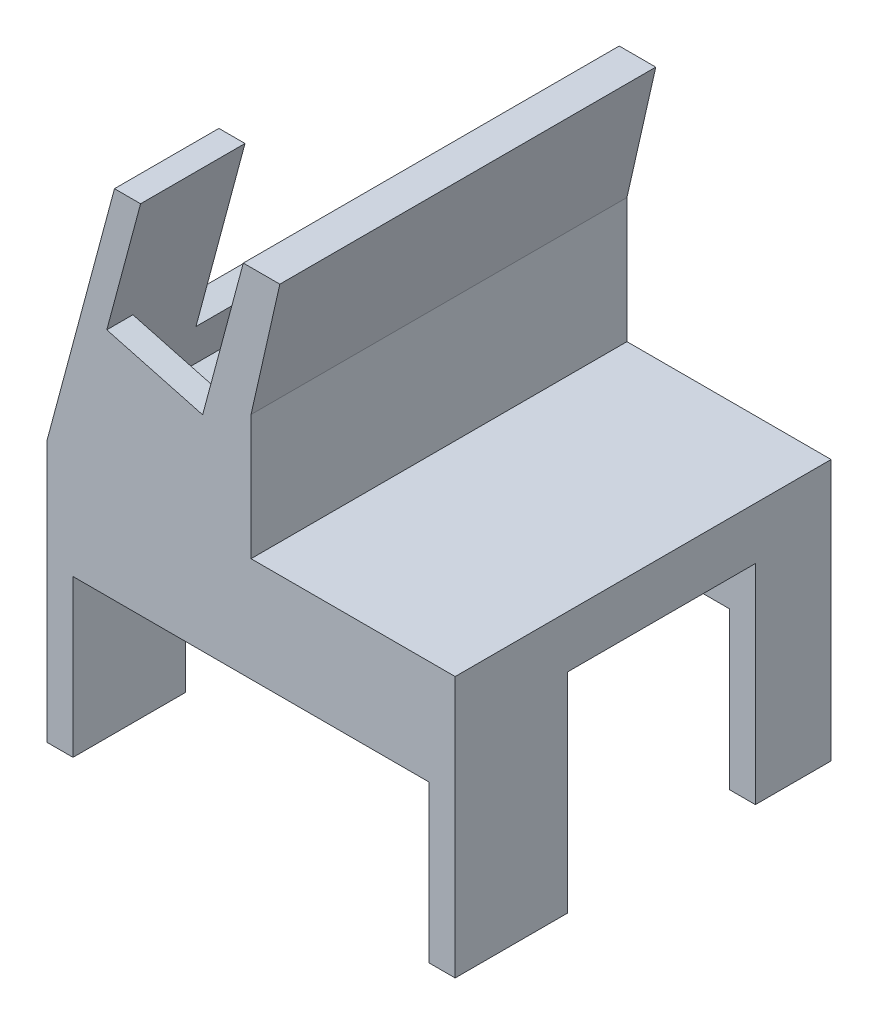
ISO-10303-21;
HEADER;
FILE_DESCRIPTION(('STEP AP214'),'2;1');
FILE_NAME('part.step','',(''),(''),'','','');
FILE_SCHEMA(('AUTOMOTIVE_DESIGN { 1 0 10303 214 1 1 1 1 }'));
ENDSEC;
DATA;
#1=APPLICATION_CONTEXT('core data for automotive mechanical design processes');
#2=APPLICATION_PROTOCOL_DEFINITION('international standard','automotive_design',2000,#1);
#3=PRODUCT_CONTEXT('',#1,'mechanical');
#4=PRODUCT('Part','Part','',(#3));
#5=PRODUCT_RELATED_PRODUCT_CATEGORY('part','',(#4));
#6=PRODUCT_DEFINITION_FORMATION('','',#4);
#7=PRODUCT_DEFINITION_CONTEXT('part definition',#1,'design');
#8=PRODUCT_DEFINITION('design','',#6,#7);
#9=PRODUCT_DEFINITION_SHAPE('','',#8);
#10=(LENGTH_UNIT() NAMED_UNIT(*) SI_UNIT(.MILLI.,.METRE.));
#11=(NAMED_UNIT(*) PLANE_ANGLE_UNIT() SI_UNIT($,.RADIAN.));
#12=(NAMED_UNIT(*) SI_UNIT($,.STERADIAN.) SOLID_ANGLE_UNIT());
#13=UNCERTAINTY_MEASURE_WITH_UNIT(LENGTH_MEASURE(1.E-05),#10,'distance_accuracy_value','');
#14=(GEOMETRIC_REPRESENTATION_CONTEXT(3) GLOBAL_UNCERTAINTY_ASSIGNED_CONTEXT((#13)) GLOBAL_UNIT_ASSIGNED_CONTEXT((#10,
#11,#12)) REPRESENTATION_CONTEXT('',''));
#15=CARTESIAN_POINT('',(0.,0.,0.));
#16=DIRECTION('',(0.,0.,1.));
#17=DIRECTION('',(1.,0.,0.));
#18=AXIS2_PLACEMENT_3D('',#15,#16,#17);
#19=CARTESIAN_POINT('',(-56.4103801603801,13.5714285714286,67.));
#20=DIRECTION('',(-0.965925826289069,0.258819045102518,0.));
#21=DIRECTION('',(-0.258819045102518,-0.965925826289069,0.));
#22=AXIS2_PLACEMENT_3D('',#19,#20,#21);
#23=PLANE('',#22);
#24=DIRECTION('',(0.,0.,1.));
#25=VECTOR('',#24,1.);
#26=CARTESIAN_POINT('',(-43.4694279052542,61.867719885882,67.));
#27=LINE('',#26,#25);
#28=CARTESIAN_POINT('',(-43.4694279052542,61.867719885882,52.));
#29=VERTEX_POINT('',#28);
#30=CARTESIAN_POINT('',(-43.4694279052542,61.867719885882,72.));
#31=VERTEX_POINT('',#30);
#32=EDGE_CURVE('E376',#29,#31,#27,.T.);
#33=ORIENTED_EDGE('',*,*,#32,.F.);
#34=DIRECTION('',(-0.258819045102518,-0.965925826289069,0.));
#35=VECTOR('',#34,1.);
#36=CARTESIAN_POINT('',(-42.6738092932145,64.8370089694618,52.));
#37=LINE('',#36,#35);
#38=CARTESIAN_POINT('',(-52.5280944838424,28.0603159657646,52.));
#39=VERTEX_POINT('',#38);
#40=EDGE_CURVE('E295',#29,#39,#37,.T.);
#41=ORIENTED_EDGE('',*,*,#40,.T.);
#42=DIRECTION('',(0.,0.,1.));
#43=VECTOR('',#42,1.);
#44=CARTESIAN_POINT('',(-52.5280944838424,28.0603159657646,0.));
#45=LINE('',#44,#43);
#46=CARTESIAN_POINT('',(-52.5280944838424,28.0603159657646,0.));
#47=VERTEX_POINT('',#46);
#48=EDGE_CURVE('E288',#47,#39,#45,.T.);
#49=ORIENTED_EDGE('',*,*,#48,.F.);
#50=DIRECTION('',(0.258819045102518,0.965925826289069,0.));
#51=VECTOR('',#50,1.);
#52=CARTESIAN_POINT('',(-56.0244583510607,15.0117083715576,0.));
#53=LINE('',#52,#51);
#54=CARTESIAN_POINT('',(-56.4103801603801,13.5714285714286,0.));
#55=VERTEX_POINT('',#54);
#56=EDGE_CURVE('E300',#55,#47,#53,.T.);
#57=ORIENTED_EDGE('',*,*,#56,.F.);
#58=DIRECTION('',(0.,0.,-1.));
#59=VECTOR('',#58,1.);
#60=CARTESIAN_POINT('',(-56.4103801603801,13.5714285714286,72.));
#61=LINE('',#60,#59);
#62=CARTESIAN_POINT('',(-56.4103801603801,13.5714285714286,72.));
#63=VERTEX_POINT('',#62);
#64=EDGE_CURVE('E483',#63,#55,#61,.T.);
#65=ORIENTED_EDGE('',*,*,#64,.F.);
#66=DIRECTION('',(-0.258819045102518,-0.965925826289069,0.));
#67=VECTOR('',#66,1.);
#68=CARTESIAN_POINT('',(-56.4103801603801,13.5714285714286,72.));
#69=LINE('',#68,#67);
#70=EDGE_CURVE('E346',#31,#63,#69,.T.);
#71=ORIENTED_EDGE('',*,*,#70,.F.);
#72=EDGE_LOOP('',(#33,#41,#49,#57,#65,#71));
#73=FACE_BOUND('',#72,.T.);
#74=ADVANCED_FACE('F101',(#73),#23,.T.);
#75=CARTESIAN_POINT('',(-43.4694279052542,61.867719885882,67.));
#76=DIRECTION('',(0.,1.,0.));
#77=DIRECTION('',(0.,0.,1.));
#78=AXIS2_PLACEMENT_3D('',#75,#76,#77);
#79=PLANE('',#78);
#80=DIRECTION('',(0.,0.,1.));
#81=VECTOR('',#80,1.);
#82=CARTESIAN_POINT('',(-38.4694279052542,61.867719885882,67.));
#83=LINE('',#82,#81);
#84=CARTESIAN_POINT('',(-38.4694279052542,61.867719885882,52.));
#85=VERTEX_POINT('',#84);
#86=CARTESIAN_POINT('',(-38.4694279052542,61.867719885882,72.));
#87=VERTEX_POINT('',#86);
#88=EDGE_CURVE('E380',#85,#87,#83,.T.);
#89=ORIENTED_EDGE('',*,*,#88,.F.);
#90=DIRECTION('',(-1.,0.,0.));
#91=VECTOR('',#90,1.);
#92=CARTESIAN_POINT('',(-43.4694279052542,61.867719885882,52.));
#93=LINE('',#92,#91);
#94=EDGE_CURVE('E599',#85,#29,#93,.T.);
#95=ORIENTED_EDGE('',*,*,#94,.T.);
#96=ORIENTED_EDGE('',*,*,#32,.T.);
#97=DIRECTION('',(-1.,0.,0.));
#98=VECTOR('',#97,1.);
#99=CARTESIAN_POINT('',(-43.4694279052542,61.867719885882,72.));
#100=LINE('',#99,#98);
#101=EDGE_CURVE('E369',#87,#31,#100,.T.);
#102=ORIENTED_EDGE('',*,*,#101,.F.);
#103=EDGE_LOOP('',(#89,#95,#96,#102));
#104=FACE_BOUND('',#103,.T.);
#105=ADVANCED_FACE('F597',(#104),#79,.T.);
#106=CARTESIAN_POINT('',(-38.4694279052542,61.867719885882,67.));
#107=DIRECTION('',(0.965925826289069,-0.258819045102518,0.));
#108=DIRECTION('',(0.258819045102518,0.965925826289069,0.));
#109=AXIS2_PLACEMENT_3D('',#106,#107,#108);
#110=PLANE('',#109);
#111=DIRECTION('',(0.,0.,-1.));
#112=VECTOR('',#111,1.);
#113=CARTESIAN_POINT('',(-47.8630309743813,26.8103159657646,67.));
#114=LINE('',#113,#112);
#115=CARTESIAN_POINT('',(-47.8630309743813,26.8103159657646,52.));
#116=VERTEX_POINT('',#115);
#117=CARTESIAN_POINT('',(-47.8630309743813,26.8103159657646,0.));
#118=VERTEX_POINT('',#117);
#119=EDGE_CURVE('E110',#116,#118,#114,.T.);
#120=ORIENTED_EDGE('',*,*,#119,.F.);
#121=DIRECTION('',(0.258819045102518,0.965925826289069,0.));
#122=VECTOR('',#121,1.);
#123=CARTESIAN_POINT('',(-38.4694279052542,61.867719885882,52.));
#124=LINE('',#123,#122);
#125=EDGE_CURVE('E12',#116,#85,#124,.T.);
#126=ORIENTED_EDGE('',*,*,#125,.T.);
#127=ORIENTED_EDGE('',*,*,#88,.T.);
#128=DIRECTION('',(0.258819045102518,0.965925826289069,0.));
#129=VECTOR('',#128,1.);
#130=CARTESIAN_POINT('',(-38.4694279052542,61.867719885882,72.));
#131=LINE('',#130,#129);
#132=CARTESIAN_POINT('',(-44.9399040328172,37.7195742286553,72.));
#133=VERTEX_POINT('',#132);
#134=EDGE_CURVE('E365',#133,#87,#131,.T.);
#135=ORIENTED_EDGE('',*,*,#134,.F.);
#136=DIRECTION('',(0.,0.,1.));
#137=VECTOR('',#136,1.);
#138=CARTESIAN_POINT('',(-44.9399040328172,37.7195742286553,67.));
#139=LINE('',#138,#137);
#140=CARTESIAN_POINT('',(-44.9399040328172,37.7195742286553,67.));
#141=VERTEX_POINT('',#140);
#142=EDGE_CURVE('E383',#141,#133,#139,.T.);
#143=ORIENTED_EDGE('',*,*,#142,.F.);
#144=DIRECTION('',(0.258819045102518,0.965925826289069,0.));
#145=VECTOR('',#144,1.);
#146=CARTESIAN_POINT('',(-51.3593948415996,13.7617083715576,67.));
#147=LINE('',#146,#145);
#148=CARTESIAN_POINT('',(-50.0927234320809,18.4889904283764,67.));
#149=VERTEX_POINT('',#148);
#150=EDGE_CURVE('E558',#149,#141,#147,.T.);
#151=ORIENTED_EDGE('',*,*,#150,.F.);
#152=DIRECTION('',(0.,0.,1.));
#153=VECTOR('',#152,1.);
#154=CARTESIAN_POINT('',(-50.0927234320809,18.4889904283764,0.));
#155=LINE('',#154,#153);
#156=CARTESIAN_POINT('',(-50.0927234320809,18.4889904283764,0.));
#157=VERTEX_POINT('',#156);
#158=EDGE_CURVE('E324',#157,#149,#155,.T.);
#159=ORIENTED_EDGE('',*,*,#158,.F.);
#160=DIRECTION('',(-0.258819045102518,-0.965925826289069,0.));
#161=VECTOR('',#160,1.);
#162=CARTESIAN_POINT('',(-51.3593948415996,13.7617083715576,0.));
#163=LINE('',#162,#161);
#164=EDGE_CURVE('E317',#118,#157,#163,.T.);
#165=ORIENTED_EDGE('',*,*,#164,.F.);
#166=EDGE_LOOP('',(#120,#126,#127,#135,#143,#151,#159,#165));
#167=FACE_BOUND('',#166,.T.);
#168=ADVANCED_FACE('F633',(#167),#110,.T.);
#169=CARTESIAN_POINT('',(0.,0.,67.));
#170=DIRECTION('',(0.,0.,-1.));
#171=DIRECTION('',(-1.,0.,0.));
#172=AXIS2_PLACEMENT_3D('',#169,#170,#171);
#173=PLANE('',#172);
#174=DIRECTION('',(0.965925826289069,-0.258819045102518,0.));
#175=VECTOR('',#174,1.);
#176=CARTESIAN_POINT('',(1.26667140951872,4.72728205681879,67.));
#177=LINE('',#176,#175);
#178=CARTESIAN_POINT('',(-31.7401327325886,13.5714285714286,67.));
#179=VERTEX_POINT('',#178);
#180=EDGE_CURVE('E320',#149,#179,#177,.T.);
#181=ORIENTED_EDGE('',*,*,#180,.F.);
#182=ORIENTED_EDGE('',*,*,#150,.T.);
#183=DIRECTION('',(-0.965925826289069,0.258819045102518,0.));
#184=VECTOR('',#183,1.);
#185=CARTESIAN_POINT('',(-44.9399040328172,37.7195742286553,67.));
#186=LINE('',#185,#184);
#187=CARTESIAN_POINT('',(-26.5873133333249,32.8020123717075,67.));
#188=VERTEX_POINT('',#187);
#189=EDGE_CURVE('E341',#188,#141,#186,.T.);
#190=ORIENTED_EDGE('',*,*,#189,.F.);
#191=DIRECTION('',(0.258819045102517,0.965925826289069,0.));
#192=VECTOR('',#191,1.);
#193=CARTESIAN_POINT('',(-33.0068041421073,8.84414651460977,67.));
#194=LINE('',#193,#192);
#195=EDGE_CURVE('E532',#179,#188,#194,.T.);
#196=ORIENTED_EDGE('',*,*,#195,.F.);
#197=EDGE_LOOP('',(#181,#182,#190,#196));
#198=FACE_BOUND('',#197,.T.);
#199=ADVANCED_FACE('F617',(#198),#173,.T.);
#200=CARTESIAN_POINT('',(0.,13.5714285714286,72.));
#201=DIRECTION('',(0.,1.,0.));
#202=DIRECTION('',(0.,0.,1.));
#203=AXIS2_PLACEMENT_3D('',#200,#201,#202);
#204=PLANE('',#203);
#205=DIRECTION('',(1.,0.,0.));
#206=VECTOR('',#205,1.);
#207=CARTESIAN_POINT('',(0.,13.5714285714286,0.));
#208=LINE('',#207,#206);
#209=CARTESIAN_POINT('',(-17.3169735669735,13.5714285714286,0.));
#210=VERTEX_POINT('',#209);
#211=CARTESIAN_POINT('',(21.7764330264331,13.5714285714286,0.));
#212=VERTEX_POINT('',#211);
#213=EDGE_CURVE('E501',#210,#212,#208,.T.);
#214=ORIENTED_EDGE('',*,*,#213,.F.);
#215=DIRECTION('',(0.,0.,1.));
#216=VECTOR('',#215,1.);
#217=CARTESIAN_POINT('',(-17.3169735669735,13.5714285714286,67.));
#218=LINE('',#217,#216);
#219=CARTESIAN_POINT('',(-17.3169735669735,13.5714285714286,72.));
#220=VERTEX_POINT('',#219);
#221=EDGE_CURVE('E345',#210,#220,#218,.T.);
#222=ORIENTED_EDGE('',*,*,#221,.T.);
#223=DIRECTION('',(1.,0.,0.));
#224=VECTOR('',#223,1.);
#225=CARTESIAN_POINT('',(0.,13.5714285714286,72.));
#226=LINE('',#225,#224);
#227=CARTESIAN_POINT('',(21.7764330264331,13.5714285714286,72.));
#228=VERTEX_POINT('',#227);
#229=EDGE_CURVE('E476',#220,#228,#226,.T.);
#230=ORIENTED_EDGE('',*,*,#229,.T.);
#231=DIRECTION('',(0.,0.,-1.));
#232=VECTOR('',#231,1.);
#233=CARTESIAN_POINT('',(21.7764330264331,13.5714285714286,72.));
#234=LINE('',#233,#232);
#235=EDGE_CURVE('E508',#228,#212,#234,.T.);
#236=ORIENTED_EDGE('',*,*,#235,.T.);
#237=EDGE_LOOP('',(#214,#222,#230,#236));
#238=FACE_BOUND('',#237,.T.);
#239=ADVANCED_FACE('F686',(#238),#204,.T.);
#240=CARTESIAN_POINT('',(16.7764330264331,0.,72.));
#241=DIRECTION('',(1.,0.,0.));
#242=DIRECTION('',(0.,0.,-1.));
#243=AXIS2_PLACEMENT_3D('',#240,#241,#242);
#244=PLANE('',#243);
#245=DIRECTION('',(0.,0.,-1.));
#246=VECTOR('',#245,1.);
#247=CARTESIAN_POINT('',(16.7764330264331,-6.42857142857144,72.));
#248=LINE('',#247,#246);
#249=CARTESIAN_POINT('',(16.7764330264331,-6.42857142857144,72.));
#250=VERTEX_POINT('',#249);
#251=CARTESIAN_POINT('',(16.7764330264331,-6.42857142857144,50.5));
#252=VERTEX_POINT('',#251);
#253=EDGE_CURVE('E523',#250,#252,#248,.T.);
#254=ORIENTED_EDGE('',*,*,#253,.T.);
#255=DIRECTION('',(0.,-1.,0.));
#256=VECTOR('',#255,1.);
#257=CARTESIAN_POINT('',(16.7764330264331,3.57142857142857,50.5));
#258=LINE('',#257,#256);
#259=CARTESIAN_POINT('',(16.7764330264331,-36.4285714285714,50.5));
#260=VERTEX_POINT('',#259);
#261=EDGE_CURVE('E410',#252,#260,#258,.T.);
#262=ORIENTED_EDGE('',*,*,#261,.T.);
#263=DIRECTION('',(0.,0.,-1.));
#264=VECTOR('',#263,1.);
#265=CARTESIAN_POINT('',(16.7764330264331,-36.4285714285714,72.));
#266=LINE('',#265,#264);
#267=CARTESIAN_POINT('',(16.7764330264331,-36.4285714285714,72.));
#268=VERTEX_POINT('',#267);
#269=EDGE_CURVE('E518',#268,#260,#266,.T.);
#270=ORIENTED_EDGE('',*,*,#269,.F.);
#271=DIRECTION('',(0.,-1.,0.));
#272=VECTOR('',#271,1.);
#273=CARTESIAN_POINT('',(16.7764330264331,0.,72.));
#274=LINE('',#273,#272);
#275=EDGE_CURVE('E465',#250,#268,#274,.T.);
#276=ORIENTED_EDGE('',*,*,#275,.F.);
#277=EDGE_LOOP('',(#254,#262,#270,#276));
#278=FACE_BOUND('',#277,.T.);
#279=ADVANCED_FACE('F689',(#278),#244,.F.);
#280=CARTESIAN_POINT('',(0.,-36.4285714285714,72.));
#281=DIRECTION('',(0.,-1.,0.));
#282=DIRECTION('',(0.,0.,-1.));
#283=AXIS2_PLACEMENT_3D('',#280,#281,#282);
#284=PLANE('',#283);
#285=DIRECTION('',(-1.,0.,0.));
#286=VECTOR('',#285,1.);
#287=CARTESIAN_POINT('',(16.7764330264331,-36.4285714285714,50.5));
#288=LINE('',#287,#286);
#289=CARTESIAN_POINT('',(21.7764330264331,-36.4285714285714,50.5));
#290=VERTEX_POINT('',#289);
#291=EDGE_CURVE('E405',#290,#260,#288,.T.);
#292=ORIENTED_EDGE('',*,*,#291,.F.);
#293=DIRECTION('',(0.,0.,-1.));
#294=VECTOR('',#293,1.);
#295=CARTESIAN_POINT('',(21.7764330264331,-36.4285714285714,72.));
#296=LINE('',#295,#294);
#297=CARTESIAN_POINT('',(21.7764330264331,-36.4285714285714,72.));
#298=VERTEX_POINT('',#297);
#299=EDGE_CURVE('E513',#298,#290,#296,.T.);
#300=ORIENTED_EDGE('',*,*,#299,.F.);
#301=DIRECTION('',(-1.,0.,0.));
#302=VECTOR('',#301,1.);
#303=CARTESIAN_POINT('',(0.,-36.4285714285714,72.));
#304=LINE('',#303,#302);
#305=EDGE_CURVE('E468',#298,#268,#304,.T.);
#306=ORIENTED_EDGE('',*,*,#305,.T.);
#307=ORIENTED_EDGE('',*,*,#269,.T.);
#308=EDGE_LOOP('',(#292,#300,#306,#307));
#309=FACE_BOUND('',#308,.T.);
#310=ADVANCED_FACE('F699',(#309),#284,.T.);
#311=CARTESIAN_POINT('',(-56.4103801603801,-36.4285714285714,72.));
#312=DIRECTION('',(0.,1.,0.));
#313=DIRECTION('',(0.,0.,1.));
#314=AXIS2_PLACEMENT_3D('',#311,#312,#313);
#315=PLANE('',#314);
#316=DIRECTION('',(0.,0.,-1.));
#317=VECTOR('',#316,1.);
#318=CARTESIAN_POINT('',(-51.4103801603801,-36.4285714285714,72.));
#319=LINE('',#318,#317);
#320=CARTESIAN_POINT('',(-51.4103801603801,-36.4285714285714,14.5));
#321=VERTEX_POINT('',#320);
#322=CARTESIAN_POINT('',(-51.4103801603801,-36.4285714285714,0.));
#323=VERTEX_POINT('',#322);
#324=EDGE_CURVE('E541',#321,#323,#319,.T.);
#325=ORIENTED_EDGE('',*,*,#324,.F.);
#326=DIRECTION('',(1.,0.,0.));
#327=VECTOR('',#326,1.);
#328=CARTESIAN_POINT('',(-51.4103801603801,-36.4285714285714,14.5));
#329=LINE('',#328,#327);
#330=CARTESIAN_POINT('',(-56.4103801603801,-36.4285714285714,14.5));
#331=VERTEX_POINT('',#330);
#332=EDGE_CURVE('E429',#331,#321,#329,.T.);
#333=ORIENTED_EDGE('',*,*,#332,.F.);
#334=DIRECTION('',(0.,0.,-1.));
#335=VECTOR('',#334,1.);
#336=CARTESIAN_POINT('',(-56.4103801603801,-36.4285714285714,72.));
#337=LINE('',#336,#335);
#338=CARTESIAN_POINT('',(-56.4103801603801,-36.4285714285714,0.));
#339=VERTEX_POINT('',#338);
#340=EDGE_CURVE('E551',#331,#339,#337,.T.);
#341=ORIENTED_EDGE('',*,*,#340,.T.);
#342=DIRECTION('',(1.,0.,0.));
#343=VECTOR('',#342,1.);
#344=CARTESIAN_POINT('',(-56.4103801603801,-36.4285714285714,0.));
#345=LINE('',#344,#343);
#346=EDGE_CURVE('E538',#339,#323,#345,.T.);
#347=ORIENTED_EDGE('',*,*,#346,.T.);
#348=EDGE_LOOP('',(#325,#333,#341,#347));
#349=FACE_BOUND('',#348,.T.);
#350=ADVANCED_FACE('F575',(#349),#315,.F.);
#351=CARTESIAN_POINT('',(-51.4103801603801,-6.42857142857144,72.));
#352=DIRECTION('',(1.,0.,0.));
#353=DIRECTION('',(0.,1.,0.));
#354=AXIS2_PLACEMENT_3D('',#351,#352,#353);
#355=PLANE('',#354);
#356=DIRECTION('',(0.,-1.,0.));
#357=VECTOR('',#356,1.);
#358=CARTESIAN_POINT('',(-51.4103801603801,3.57142857142857,14.5));
#359=LINE('',#358,#357);
#360=CARTESIAN_POINT('',(-51.4103801603801,-6.42857142857144,14.5));
#361=VERTEX_POINT('',#360);
#362=EDGE_CURVE('E434',#361,#321,#359,.T.);
#363=ORIENTED_EDGE('',*,*,#362,.T.);
#364=ORIENTED_EDGE('',*,*,#324,.T.);
#365=DIRECTION('',(0.,-1.,0.));
#366=VECTOR('',#365,1.);
#367=CARTESIAN_POINT('',(-51.4103801603801,-6.42857142857144,0.));
#368=LINE('',#367,#366);
#369=CARTESIAN_POINT('',(-51.4103801603801,-6.42857142857144,0.));
#370=VERTEX_POINT('',#369);
#371=EDGE_CURVE('E455',#370,#323,#368,.T.);
#372=ORIENTED_EDGE('',*,*,#371,.F.);
#373=DIRECTION('',(0.,0.,-1.));
#374=VECTOR('',#373,1.);
#375=CARTESIAN_POINT('',(-51.4103801603801,-6.42857142857144,72.));
#376=LINE('',#375,#374);
#377=EDGE_CURVE('E527',#361,#370,#376,.T.);
#378=ORIENTED_EDGE('',*,*,#377,.F.);
#379=EDGE_LOOP('',(#363,#364,#372,#378));
#380=FACE_BOUND('',#379,.T.);
#381=ADVANCED_FACE('F570',(#380),#355,.T.);
#382=CARTESIAN_POINT('',(0.,-6.42857142857144,72.));
#383=DIRECTION('',(0.,1.,0.));
#384=DIRECTION('',(-1.,0.,0.));
#385=AXIS2_PLACEMENT_3D('',#382,#383,#384);
#386=PLANE('',#385);
#387=CARTESIAN_POINT('',(-51.4103801603801,-6.42857142857144,72.));
#388=VERTEX_POINT('',#387);
#389=CARTESIAN_POINT('',(-51.4103801603801,-6.42857142857144,50.5));
#390=VERTEX_POINT('',#389);
#391=EDGE_CURVE('E528',#388,#390,#376,.T.);
#392=ORIENTED_EDGE('',*,*,#391,.T.);
#393=DIRECTION('',(-1.,0.,0.));
#394=VECTOR('',#393,1.);
#395=CARTESIAN_POINT('',(-51.4103801603801,-6.42857142857144,50.5));
#396=LINE('',#395,#394);
#397=EDGE_CURVE('E452',#252,#390,#396,.T.);
#398=ORIENTED_EDGE('',*,*,#397,.F.);
#399=ORIENTED_EDGE('',*,*,#253,.F.);
#400=DIRECTION('',(1.,0.,0.));
#401=VECTOR('',#400,1.);
#402=CARTESIAN_POINT('',(0.,-6.42857142857144,72.));
#403=LINE('',#402,#401);
#404=EDGE_CURVE('E462',#388,#250,#403,.T.);
#405=ORIENTED_EDGE('',*,*,#404,.F.);
#406=EDGE_LOOP('',(#392,#398,#399,#405));
#407=FACE_BOUND('',#406,.T.);
#408=ADVANCED_FACE('F704',(#407),#386,.F.);
#409=CARTESIAN_POINT('',(16.7764330264331,-6.42857142857144,14.5));
#410=VERTEX_POINT('',#409);
#411=CARTESIAN_POINT('',(16.7764330264331,-6.42857142857144,0.));
#412=VERTEX_POINT('',#411);
#413=EDGE_CURVE('E522',#410,#412,#248,.T.);
#414=ORIENTED_EDGE('',*,*,#413,.F.);
#415=DIRECTION('',(1.,0.,0.));
#416=VECTOR('',#415,1.);
#417=CARTESIAN_POINT('',(-51.4103801603801,-6.42857142857144,14.5));
#418=LINE('',#417,#416);
#419=EDGE_CURVE('E438',#361,#410,#418,.T.);
#420=ORIENTED_EDGE('',*,*,#419,.F.);
#421=ORIENTED_EDGE('',*,*,#377,.T.);
#422=DIRECTION('',(1.,0.,0.));
#423=VECTOR('',#422,1.);
#424=CARTESIAN_POINT('',(0.,-6.42857142857144,0.));
#425=LINE('',#424,#423);
#426=EDGE_CURVE('E484',#370,#412,#425,.T.);
#427=ORIENTED_EDGE('',*,*,#426,.T.);
#428=EDGE_LOOP('',(#414,#420,#421,#427));
#429=FACE_BOUND('',#428,.T.);
#430=ADVANCED_FACE('F580',(#429),#386,.F.);
#431=CARTESIAN_POINT('',(16.7764330264331,-36.4285714285714,14.5));
#432=VERTEX_POINT('',#431);
#433=CARTESIAN_POINT('',(16.7764330264331,-36.4285714285714,0.));
#434=VERTEX_POINT('',#433);
#435=EDGE_CURVE('E517',#432,#434,#266,.T.);
#436=ORIENTED_EDGE('',*,*,#435,.F.);
#437=DIRECTION('',(0.,-1.,0.));
#438=VECTOR('',#437,1.);
#439=CARTESIAN_POINT('',(16.7764330264331,3.57142857142857,14.5));
#440=LINE('',#439,#438);
#441=EDGE_CURVE('E404',#410,#432,#440,.T.);
#442=ORIENTED_EDGE('',*,*,#441,.F.);
#443=ORIENTED_EDGE('',*,*,#413,.T.);
#444=DIRECTION('',(0.,-1.,0.));
#445=VECTOR('',#444,1.);
#446=CARTESIAN_POINT('',(16.7764330264331,0.,0.));
#447=LINE('',#446,#445);
#448=EDGE_CURVE('E488',#412,#434,#447,.T.);
#449=ORIENTED_EDGE('',*,*,#448,.T.);
#450=EDGE_LOOP('',(#436,#442,#443,#449));
#451=FACE_BOUND('',#450,.T.);
#452=ADVANCED_FACE('F697',(#451),#244,.F.);
#453=DIRECTION('',(1.,0.,0.));
#454=VECTOR('',#453,1.);
#455=CARTESIAN_POINT('',(16.7764330264331,-36.4285714285714,14.5));
#456=LINE('',#455,#454);
#457=CARTESIAN_POINT('',(21.7764330264331,-36.4285714285714,14.5));
#458=VERTEX_POINT('',#457);
#459=EDGE_CURVE('E379',#432,#458,#456,.T.);
#460=ORIENTED_EDGE('',*,*,#459,.F.);
#461=ORIENTED_EDGE('',*,*,#435,.T.);
#462=DIRECTION('',(-1.,0.,0.));
#463=VECTOR('',#462,1.);
#464=CARTESIAN_POINT('',(0.,-36.4285714285714,0.));
#465=LINE('',#464,#463);
#466=CARTESIAN_POINT('',(21.7764330264331,-36.4285714285714,0.));
#467=VERTEX_POINT('',#466);
#468=EDGE_CURVE('E493',#467,#434,#465,.T.);
#469=ORIENTED_EDGE('',*,*,#468,.F.);
#470=EDGE_CURVE('E512',#458,#467,#296,.T.);
#471=ORIENTED_EDGE('',*,*,#470,.F.);
#472=EDGE_LOOP('',(#460,#461,#469,#471));
#473=FACE_BOUND('',#472,.T.);
#474=ADVANCED_FACE('F693',(#473),#284,.T.);
#475=CARTESIAN_POINT('',(21.7764330264331,0.,72.));
#476=DIRECTION('',(-1.,0.,0.));
#477=DIRECTION('',(0.,-1.,0.));
#478=AXIS2_PLACEMENT_3D('',#475,#476,#477);
#479=PLANE('',#478);
#480=ORIENTED_EDGE('',*,*,#299,.T.);
#481=DIRECTION('',(0.,-1.,0.));
#482=VECTOR('',#481,1.);
#483=CARTESIAN_POINT('',(21.7764330264331,3.57142857142857,50.5));
#484=LINE('',#483,#482);
#485=CARTESIAN_POINT('',(21.7764330264331,3.57142857142857,50.5));
#486=VERTEX_POINT('',#485);
#487=EDGE_CURVE('E415',#486,#290,#484,.T.);
#488=ORIENTED_EDGE('',*,*,#487,.F.);
#489=DIRECTION('',(0.,0.,1.));
#490=VECTOR('',#489,1.);
#491=CARTESIAN_POINT('',(21.7764330264331,3.57142857142857,50.5));
#492=LINE('',#491,#490);
#493=CARTESIAN_POINT('',(21.7764330264331,3.57142857142857,14.5));
#494=VERTEX_POINT('',#493);
#495=EDGE_CURVE('E400',#494,#486,#492,.T.);
#496=ORIENTED_EDGE('',*,*,#495,.F.);
#497=DIRECTION('',(0.,-1.,0.));
#498=VECTOR('',#497,1.);
#499=CARTESIAN_POINT('',(21.7764330264331,3.57142857142857,14.5));
#500=LINE('',#499,#498);
#501=EDGE_CURVE('E418',#494,#458,#500,.T.);
#502=ORIENTED_EDGE('',*,*,#501,.T.);
#503=ORIENTED_EDGE('',*,*,#470,.T.);
#504=DIRECTION('',(0.,1.,0.));
#505=VECTOR('',#504,1.);
#506=CARTESIAN_POINT('',(21.7764330264331,0.,0.));
#507=LINE('',#506,#505);
#508=EDGE_CURVE('E497',#467,#212,#507,.T.);
#509=ORIENTED_EDGE('',*,*,#508,.T.);
#510=ORIENTED_EDGE('',*,*,#235,.F.);
#511=DIRECTION('',(0.,1.,0.));
#512=VECTOR('',#511,1.);
#513=CARTESIAN_POINT('',(21.7764330264331,0.,72.));
#514=LINE('',#513,#512);
#515=EDGE_CURVE('E472',#298,#228,#514,.T.);
#516=ORIENTED_EDGE('',*,*,#515,.F.);
#517=EDGE_LOOP('',(#480,#488,#496,#502,#503,#509,#510,#516));
#518=FACE_BOUND('',#517,.T.);
#519=ADVANCED_FACE('F685',(#518),#479,.F.);
#520=CARTESIAN_POINT('',(-56.4103801603801,0.,72.));
#521=DIRECTION('',(-1.,0.,0.));
#522=DIRECTION('',(0.,0.,1.));
#523=AXIS2_PLACEMENT_3D('',#520,#521,#522);
#524=PLANE('',#523);
#525=DIRECTION('',(0.,-1.,0.));
#526=VECTOR('',#525,1.);
#527=CARTESIAN_POINT('',(-56.4103801603801,3.57142857142857,14.5));
#528=LINE('',#527,#526);
#529=CARTESIAN_POINT('',(-56.4103801603801,3.57142857142857,14.5));
#530=VERTEX_POINT('',#529);
#531=EDGE_CURVE('E439',#530,#331,#528,.T.);
#532=ORIENTED_EDGE('',*,*,#531,.F.);
#533=DIRECTION('',(0.,0.,-1.));
#534=VECTOR('',#533,1.);
#535=CARTESIAN_POINT('',(-56.4103801603801,3.57142857142857,14.5));
#536=LINE('',#535,#534);
#537=CARTESIAN_POINT('',(-56.4103801603801,3.57142857142857,50.5));
#538=VERTEX_POINT('',#537);
#539=EDGE_CURVE('E424',#538,#530,#536,.T.);
#540=ORIENTED_EDGE('',*,*,#539,.F.);
#541=DIRECTION('',(0.,-1.,0.));
#542=VECTOR('',#541,1.);
#543=CARTESIAN_POINT('',(-56.4103801603801,3.57142857142857,50.5));
#544=LINE('',#543,#542);
#545=CARTESIAN_POINT('',(-56.4103801603801,-36.4285714285714,50.5));
#546=VERTEX_POINT('',#545);
#547=EDGE_CURVE('E442',#538,#546,#544,.T.);
#548=ORIENTED_EDGE('',*,*,#547,.T.);
#549=CARTESIAN_POINT('',(-56.4103801603801,-36.4285714285714,72.));
#550=VERTEX_POINT('',#549);
#551=EDGE_CURVE('E489',#550,#546,#337,.T.);
#552=ORIENTED_EDGE('',*,*,#551,.F.);
#553=DIRECTION('',(0.,1.,0.));
#554=VECTOR('',#553,1.);
#555=CARTESIAN_POINT('',(-56.4103801603801,0.,72.));
#556=LINE('',#555,#554);
#557=EDGE_CURVE('E479',#550,#63,#556,.T.);
#558=ORIENTED_EDGE('',*,*,#557,.T.);
#559=ORIENTED_EDGE('',*,*,#64,.T.);
#560=DIRECTION('',(0.,1.,0.));
#561=VECTOR('',#560,1.);
#562=CARTESIAN_POINT('',(-56.4103801603801,0.,0.));
#563=LINE('',#562,#561);
#564=EDGE_CURVE('E307',#339,#55,#563,.T.);
#565=ORIENTED_EDGE('',*,*,#564,.F.);
#566=ORIENTED_EDGE('',*,*,#340,.F.);
#567=EDGE_LOOP('',(#532,#540,#548,#552,#558,#559,#565,#566));
#568=FACE_BOUND('',#567,.T.);
#569=ADVANCED_FACE('F587',(#568),#524,.T.);
#570=CARTESIAN_POINT('',(0.,0.,72.));
#571=DIRECTION('',(0.,0.,1.));
#572=DIRECTION('',(1.,0.,0.));
#573=AXIS2_PLACEMENT_3D('',#570,#571,#572);
#574=PLANE('',#573);
#575=ORIENTED_EDGE('',*,*,#557,.F.);
#576=DIRECTION('',(1.,0.,0.));
#577=VECTOR('',#576,1.);
#578=CARTESIAN_POINT('',(-56.4103801603801,-36.4285714285714,72.));
#579=LINE('',#578,#577);
#580=CARTESIAN_POINT('',(-51.4103801603801,-36.4285714285714,72.));
#581=VERTEX_POINT('',#580);
#582=EDGE_CURVE('E537',#550,#581,#579,.T.);
#583=ORIENTED_EDGE('',*,*,#582,.T.);
#584=DIRECTION('',(0.,-1.,0.));
#585=VECTOR('',#584,1.);
#586=CARTESIAN_POINT('',(-51.4103801603801,-6.42857142857144,72.));
#587=LINE('',#586,#585);
#588=EDGE_CURVE('E533',#388,#581,#587,.T.);
#589=ORIENTED_EDGE('',*,*,#588,.F.);
#590=ORIENTED_EDGE('',*,*,#404,.T.);
#591=ORIENTED_EDGE('',*,*,#275,.T.);
#592=ORIENTED_EDGE('',*,*,#305,.F.);
#593=ORIENTED_EDGE('',*,*,#515,.T.);
#594=ORIENTED_EDGE('',*,*,#229,.F.);
#595=DIRECTION('',(0.,1.,0.));
#596=VECTOR('',#595,1.);
#597=CARTESIAN_POINT('',(-17.3169735669735,13.5714285714286,72.));
#598=LINE('',#597,#596);
#599=CARTESIAN_POINT('',(-17.3169735669735,37.4842427051896,72.));
#600=VERTEX_POINT('',#599);
#601=EDGE_CURVE('E125',#220,#600,#598,.T.);
#602=ORIENTED_EDGE('',*,*,#601,.T.);
#603=DIRECTION('',(0.220711723580433,0.975339087227696,0.));
#604=VECTOR('',#603,1.);
#605=CARTESIAN_POINT('',(-17.3169735669735,37.4842427051896,72.));
#606=LINE('',#605,#604);
#607=CARTESIAN_POINT('',(-11.7991804774627,61.867719885882,72.));
#608=VERTEX_POINT('',#607);
#609=EDGE_CURVE('E349',#600,#608,#606,.T.);
#610=ORIENTED_EDGE('',*,*,#609,.T.);
#611=DIRECTION('',(-1.,0.,0.));
#612=VECTOR('',#611,1.);
#613=CARTESIAN_POINT('',(-18.7991804774627,61.867719885882,72.));
#614=LINE('',#613,#612);
#615=CARTESIAN_POINT('',(-18.7991804774627,61.867719885882,72.));
#616=VERTEX_POINT('',#615);
#617=EDGE_CURVE('E353',#608,#616,#614,.T.);
#618=ORIENTED_EDGE('',*,*,#617,.T.);
#619=DIRECTION('',(-0.258819045102517,-0.965925826289069,0.));
#620=VECTOR('',#619,1.);
#621=CARTESIAN_POINT('',(-26.5873133333249,32.8020123717075,72.));
#622=LINE('',#621,#620);
#623=CARTESIAN_POINT('',(-26.5873133333249,32.8020123717075,72.));
#624=VERTEX_POINT('',#623);
#625=EDGE_CURVE('E357',#616,#624,#622,.T.);
#626=ORIENTED_EDGE('',*,*,#625,.T.);
#627=DIRECTION('',(-0.965925826289069,0.258819045102518,0.));
#628=VECTOR('',#627,1.);
#629=CARTESIAN_POINT('',(-44.9399040328172,37.7195742286553,72.));
#630=LINE('',#629,#628);
#631=EDGE_CURVE('E361',#624,#133,#630,.T.);
#632=ORIENTED_EDGE('',*,*,#631,.T.);
#633=ORIENTED_EDGE('',*,*,#134,.T.);
#634=ORIENTED_EDGE('',*,*,#101,.T.);
#635=ORIENTED_EDGE('',*,*,#70,.T.);
#636=EDGE_LOOP('',(#575,#583,#589,#590,#591,#592,#593,#594,#602,#610,#618,#626,#632,#633,#634,#635));
#637=FACE_BOUND('',#636,.T.);
#638=ADVANCED_FACE('F592',(#637),#574,.T.);
#639=CARTESIAN_POINT('',(0.,0.,0.));
#640=DIRECTION('',(0.,0.,1.));
#641=DIRECTION('',(1.,0.,0.));
#642=AXIS2_PLACEMENT_3D('',#639,#640,#641);
#643=PLANE('',#642);
#644=ORIENTED_EDGE('',*,*,#56,.T.);
#645=DIRECTION('',(-0.965925826289069,0.258819045102518,0.));
#646=VECTOR('',#645,1.);
#647=CARTESIAN_POINT('',(-47.698465352397,26.766220740252,0.));
#648=LINE('',#647,#646);
#649=EDGE_CURVE('E285',#118,#47,#648,.T.);
#650=ORIENTED_EDGE('',*,*,#649,.F.);
#651=ORIENTED_EDGE('',*,*,#164,.T.);
#652=DIRECTION('',(0.965925826289069,-0.258819045102518,0.));
#653=VECTOR('',#652,1.);
#654=CARTESIAN_POINT('',(1.26667140951872,4.72728205681879,0.));
#655=LINE('',#654,#653);
#656=CARTESIAN_POINT('',(-31.7401327325886,13.5714285714286,0.));
#657=VERTEX_POINT('',#656);
#658=EDGE_CURVE('E310',#157,#657,#655,.T.);
#659=ORIENTED_EDGE('',*,*,#658,.T.);
#660=DIRECTION('',(-0.258819045102518,-0.965925826289069,0.));
#661=VECTOR('',#660,1.);
#662=CARTESIAN_POINT('',(-33.0068041421073,8.84414651460977,0.));
#663=LINE('',#662,#661);
#664=CARTESIAN_POINT('',(-18.7991804774627,61.867719885882,0.));
#665=VERTEX_POINT('',#664);
#666=EDGE_CURVE('E309',#665,#657,#663,.T.);
#667=ORIENTED_EDGE('',*,*,#666,.F.);
#668=DIRECTION('',(1.,0.,0.));
#669=VECTOR('',#668,1.);
#670=CARTESIAN_POINT('',(0.,61.867719885882,0.));
#671=LINE('',#670,#669);
#672=CARTESIAN_POINT('',(-11.7991804774627,61.867719885882,0.));
#673=VERTEX_POINT('',#672);
#674=EDGE_CURVE('E315',#665,#673,#671,.T.);
#675=ORIENTED_EDGE('',*,*,#674,.T.);
#676=DIRECTION('',(-0.220711723580433,-0.975339087227696,0.));
#677=VECTOR('',#676,1.);
#678=CARTESIAN_POINT('',(-24.542587178766,5.55379845664272,0.));
#679=LINE('',#678,#677);
#680=CARTESIAN_POINT('',(-17.3169735669735,37.4842427051896,0.));
#681=VERTEX_POINT('',#680);
#682=EDGE_CURVE('E329',#673,#681,#679,.T.);
#683=ORIENTED_EDGE('',*,*,#682,.T.);
#684=DIRECTION('',(0.,-1.,0.));
#685=VECTOR('',#684,1.);
#686=CARTESIAN_POINT('',(-17.3169735669735,0.,0.));
#687=LINE('',#686,#685);
#688=EDGE_CURVE('E333',#681,#210,#687,.T.);
#689=ORIENTED_EDGE('',*,*,#688,.T.);
#690=ORIENTED_EDGE('',*,*,#213,.T.);
#691=ORIENTED_EDGE('',*,*,#508,.F.);
#692=ORIENTED_EDGE('',*,*,#468,.T.);
#693=ORIENTED_EDGE('',*,*,#448,.F.);
#694=ORIENTED_EDGE('',*,*,#426,.F.);
#695=ORIENTED_EDGE('',*,*,#371,.T.);
#696=ORIENTED_EDGE('',*,*,#346,.F.);
#697=ORIENTED_EDGE('',*,*,#564,.T.);
#698=EDGE_LOOP('',(#644,#650,#651,#659,#667,#675,#683,#689,#690,#691,#692,#693,#694,#695,#696,#697));
#699=FACE_BOUND('',#698,.T.);
#700=ADVANCED_FACE('F304',(#699),#643,.F.);
#701=ORIENTED_EDGE('',*,*,#551,.T.);
#702=DIRECTION('',(-1.,0.,0.));
#703=VECTOR('',#702,1.);
#704=CARTESIAN_POINT('',(-51.4103801603801,-36.4285714285714,50.5));
#705=LINE('',#704,#703);
#706=CARTESIAN_POINT('',(-51.4103801603801,-36.4285714285714,50.5));
#707=VERTEX_POINT('',#706);
#708=EDGE_CURVE('E414',#707,#546,#705,.T.);
#709=ORIENTED_EDGE('',*,*,#708,.F.);
#710=EDGE_CURVE('E552',#581,#707,#319,.T.);
#711=ORIENTED_EDGE('',*,*,#710,.F.);
#712=ORIENTED_EDGE('',*,*,#582,.F.);
#713=EDGE_LOOP('',(#701,#709,#711,#712));
#714=FACE_BOUND('',#713,.T.);
#715=ADVANCED_FACE('F682',(#714),#315,.F.);
#716=DIRECTION('',(0.,-1.,0.));
#717=VECTOR('',#716,1.);
#718=CARTESIAN_POINT('',(-51.4103801603801,3.57142857142857,50.5));
#719=LINE('',#718,#717);
#720=EDGE_CURVE('E428',#390,#707,#719,.T.);
#721=ORIENTED_EDGE('',*,*,#720,.F.);
#722=ORIENTED_EDGE('',*,*,#391,.F.);
#723=ORIENTED_EDGE('',*,*,#588,.T.);
#724=ORIENTED_EDGE('',*,*,#710,.T.);
#725=EDGE_LOOP('',(#721,#722,#723,#724));
#726=FACE_BOUND('',#725,.T.);
#727=ADVANCED_FACE('F103',(#726),#355,.T.);
#728=CARTESIAN_POINT('',(-51.4103801603801,3.57142857142856,50.5));
#729=DIRECTION('',(0.,0.,1.));
#730=DIRECTION('',(1.,0.,0.));
#731=AXIS2_PLACEMENT_3D('',#728,#729,#730);
#732=PLANE('',#731);
#733=ORIENTED_EDGE('',*,*,#397,.T.);
#734=ORIENTED_EDGE('',*,*,#720,.T.);
#735=ORIENTED_EDGE('',*,*,#708,.T.);
#736=ORIENTED_EDGE('',*,*,#547,.F.);
#737=DIRECTION('',(-1.,0.,0.));
#738=VECTOR('',#737,1.);
#739=CARTESIAN_POINT('',(-51.4103801603801,3.57142857142856,50.5));
#740=LINE('',#739,#738);
#741=EDGE_CURVE('E451',#486,#538,#740,.T.);
#742=ORIENTED_EDGE('',*,*,#741,.F.);
#743=ORIENTED_EDGE('',*,*,#487,.T.);
#744=ORIENTED_EDGE('',*,*,#291,.T.);
#745=ORIENTED_EDGE('',*,*,#261,.F.);
#746=EDGE_LOOP('',(#733,#734,#735,#736,#742,#743,#744,#745));
#747=FACE_BOUND('',#746,.T.);
#748=ADVANCED_FACE('F672',(#747),#732,.F.);
#749=CARTESIAN_POINT('',(-51.4103801603801,3.57142857142856,14.5));
#750=DIRECTION('',(0.,0.,-1.));
#751=DIRECTION('',(-1.,0.,0.));
#752=AXIS2_PLACEMENT_3D('',#749,#750,#751);
#753=PLANE('',#752);
#754=ORIENTED_EDGE('',*,*,#419,.T.);
#755=ORIENTED_EDGE('',*,*,#441,.T.);
#756=ORIENTED_EDGE('',*,*,#459,.T.);
#757=ORIENTED_EDGE('',*,*,#501,.F.);
#758=DIRECTION('',(1.,0.,0.));
#759=VECTOR('',#758,1.);
#760=CARTESIAN_POINT('',(-51.4103801603801,3.57142857142856,14.5));
#761=LINE('',#760,#759);
#762=EDGE_CURVE('E448',#530,#494,#761,.T.);
#763=ORIENTED_EDGE('',*,*,#762,.F.);
#764=ORIENTED_EDGE('',*,*,#531,.T.);
#765=ORIENTED_EDGE('',*,*,#332,.T.);
#766=ORIENTED_EDGE('',*,*,#362,.F.);
#767=EDGE_LOOP('',(#754,#755,#756,#757,#763,#764,#765,#766));
#768=FACE_BOUND('',#767,.T.);
#769=ADVANCED_FACE('F583',(#768),#753,.F.);
#770=CARTESIAN_POINT('',(0.,3.57142857142856,0.));
#771=DIRECTION('',(0.,1.,0.));
#772=DIRECTION('',(-1.,0.,0.));
#773=AXIS2_PLACEMENT_3D('',#770,#771,#772);
#774=PLANE('',#773);
#775=ORIENTED_EDGE('',*,*,#741,.T.);
#776=ORIENTED_EDGE('',*,*,#539,.T.);
#777=ORIENTED_EDGE('',*,*,#762,.T.);
#778=ORIENTED_EDGE('',*,*,#495,.T.);
#779=EDGE_LOOP('',(#775,#776,#777,#778));
#780=FACE_BOUND('',#779,.T.);
#781=ADVANCED_FACE('F658',(#780),#774,.F.);
#782=CARTESIAN_POINT('',(-44.9399040328172,37.7195742286553,67.));
#783=DIRECTION('',(0.258819045102518,0.965925826289069,0.));
#784=DIRECTION('',(-0.965925826289069,0.258819045102518,0.));
#785=AXIS2_PLACEMENT_3D('',#782,#783,#784);
#786=PLANE('',#785);
#787=ORIENTED_EDGE('',*,*,#631,.F.);
#788=DIRECTION('',(0.,0.,1.));
#789=VECTOR('',#788,1.);
#790=CARTESIAN_POINT('',(-26.5873133333249,32.8020123717075,67.));
#791=LINE('',#790,#789);
#792=EDGE_CURVE('E386',#188,#624,#791,.T.);
#793=ORIENTED_EDGE('',*,*,#792,.F.);
#794=ORIENTED_EDGE('',*,*,#189,.T.);
#795=ORIENTED_EDGE('',*,*,#142,.T.);
#796=EDGE_LOOP('',(#787,#793,#794,#795));
#797=FACE_BOUND('',#796,.T.);
#798=ADVANCED_FACE('F626',(#797),#786,.T.);
#799=CARTESIAN_POINT('',(-26.5873133333249,32.8020123717075,67.));
#800=DIRECTION('',(-0.965925826289069,0.258819045102517,0.));
#801=DIRECTION('',(-0.258819045102517,-0.965925826289069,0.));
#802=AXIS2_PLACEMENT_3D('',#799,#800,#801);
#803=PLANE('',#802);
#804=ORIENTED_EDGE('',*,*,#625,.F.);
#805=DIRECTION('',(0.,0.,1.));
#806=VECTOR('',#805,1.);
#807=CARTESIAN_POINT('',(-18.7991804774627,61.867719885882,67.));
#808=LINE('',#807,#806);
#809=EDGE_CURVE('E389',#665,#616,#808,.T.);
#810=ORIENTED_EDGE('',*,*,#809,.F.);
#811=ORIENTED_EDGE('',*,*,#666,.T.);
#812=DIRECTION('',(0.,0.,1.));
#813=VECTOR('',#812,1.);
#814=CARTESIAN_POINT('',(-31.7401327325886,13.5714285714286,0.));
#815=LINE('',#814,#813);
#816=EDGE_CURVE('E337',#657,#179,#815,.T.);
#817=ORIENTED_EDGE('',*,*,#816,.T.);
#818=ORIENTED_EDGE('',*,*,#195,.T.);
#819=ORIENTED_EDGE('',*,*,#792,.T.);
#820=EDGE_LOOP('',(#804,#810,#811,#817,#818,#819));
#821=FACE_BOUND('',#820,.T.);
#822=ADVANCED_FACE('F623',(#821),#803,.T.);
#823=CARTESIAN_POINT('',(-18.7991804774627,61.867719885882,67.));
#824=DIRECTION('',(0.,1.,0.));
#825=DIRECTION('',(0.,0.,1.));
#826=AXIS2_PLACEMENT_3D('',#823,#824,#825);
#827=PLANE('',#826);
#828=ORIENTED_EDGE('',*,*,#617,.F.);
#829=DIRECTION('',(0.,0.,1.));
#830=VECTOR('',#829,1.);
#831=CARTESIAN_POINT('',(-11.7991804774627,61.867719885882,67.));
#832=LINE('',#831,#830);
#833=EDGE_CURVE('E392',#673,#608,#832,.T.);
#834=ORIENTED_EDGE('',*,*,#833,.F.);
#835=ORIENTED_EDGE('',*,*,#674,.F.);
#836=ORIENTED_EDGE('',*,*,#809,.T.);
#837=EDGE_LOOP('',(#828,#834,#835,#836));
#838=FACE_BOUND('',#837,.T.);
#839=ADVANCED_FACE('F631',(#838),#827,.T.);
#840=CARTESIAN_POINT('',(-17.3169735669735,37.4842427051896,67.));
#841=DIRECTION('',(0.975339087227696,-0.220711723580433,0.));
#842=DIRECTION('',(0.220711723580433,0.975339087227696,0.));
#843=AXIS2_PLACEMENT_3D('',#840,#841,#842);
#844=PLANE('',#843);
#845=ORIENTED_EDGE('',*,*,#609,.F.);
#846=DIRECTION('',(0.,0.,1.));
#847=VECTOR('',#846,1.);
#848=CARTESIAN_POINT('',(-17.3169735669735,37.4842427051896,67.));
#849=LINE('',#848,#847);
#850=EDGE_CURVE('E395',#681,#600,#849,.T.);
#851=ORIENTED_EDGE('',*,*,#850,.F.);
#852=ORIENTED_EDGE('',*,*,#682,.F.);
#853=ORIENTED_EDGE('',*,*,#833,.T.);
#854=EDGE_LOOP('',(#845,#851,#852,#853));
#855=FACE_BOUND('',#854,.T.);
#856=ADVANCED_FACE('F663',(#855),#844,.T.);
#857=CARTESIAN_POINT('',(-17.3169735669735,13.5714285714286,67.));
#858=DIRECTION('',(1.,0.,0.));
#859=DIRECTION('',(0.,0.,-1.));
#860=AXIS2_PLACEMENT_3D('',#857,#858,#859);
#861=PLANE('',#860);
#862=ORIENTED_EDGE('',*,*,#601,.F.);
#863=ORIENTED_EDGE('',*,*,#221,.F.);
#864=ORIENTED_EDGE('',*,*,#688,.F.);
#865=ORIENTED_EDGE('',*,*,#850,.T.);
#866=EDGE_LOOP('',(#862,#863,#864,#865));
#867=FACE_BOUND('',#866,.T.);
#868=ADVANCED_FACE('F644',(#867),#861,.T.);
#869=CARTESIAN_POINT('',(1.26667140951872,4.72728205681879,0.));
#870=DIRECTION('',(-0.258819045102518,-0.965925826289069,0.));
#871=DIRECTION('',(0.965925826289069,-0.258819045102518,0.));
#872=AXIS2_PLACEMENT_3D('',#869,#870,#871);
#873=PLANE('',#872);
#874=ORIENTED_EDGE('',*,*,#180,.T.);
#875=ORIENTED_EDGE('',*,*,#816,.F.);
#876=ORIENTED_EDGE('',*,*,#658,.F.);
#877=ORIENTED_EDGE('',*,*,#158,.T.);
#878=EDGE_LOOP('',(#874,#875,#876,#877));
#879=FACE_BOUND('',#878,.T.);
#880=ADVANCED_FACE('F612',(#879),#873,.F.);
#881=CARTESIAN_POINT('',(-37.8441801617692,63.5429137439492,52.));
#882=DIRECTION('',(0.,0.,-1.));
#883=DIRECTION('',(0.,1.,0.));
#884=AXIS2_PLACEMENT_3D('',#881,#882,#883);
#885=PLANE('',#884);
#886=ORIENTED_EDGE('',*,*,#125,.F.);
#887=DIRECTION('',(-0.965925826289069,0.258819045102518,0.));
#888=VECTOR('',#887,1.);
#889=CARTESIAN_POINT('',(-47.698465352397,26.766220740252,52.));
#890=LINE('',#889,#888);
#891=EDGE_CURVE('E117',#116,#39,#890,.T.);
#892=ORIENTED_EDGE('',*,*,#891,.T.);
#893=ORIENTED_EDGE('',*,*,#40,.F.);
#894=ORIENTED_EDGE('',*,*,#94,.F.);
#895=EDGE_LOOP('',(#886,#892,#893,#894));
#896=FACE_BOUND('',#895,.T.);
#897=ADVANCED_FACE('F634',(#896),#885,.T.);
#898=CARTESIAN_POINT('',(-47.698465352397,26.766220740252,0.));
#899=DIRECTION('',(-0.258819045102518,-0.965925826289069,0.));
#900=DIRECTION('',(0.965925826289069,-0.258819045102518,0.));
#901=AXIS2_PLACEMENT_3D('',#898,#899,#900);
#902=PLANE('',#901);
#903=ORIENTED_EDGE('',*,*,#119,.T.);
#904=ORIENTED_EDGE('',*,*,#649,.T.);
#905=ORIENTED_EDGE('',*,*,#48,.T.);
#906=ORIENTED_EDGE('',*,*,#891,.F.);
#907=EDGE_LOOP('',(#903,#904,#905,#906));
#908=FACE_BOUND('',#907,.T.);
#909=ADVANCED_FACE('F287',(#908),#902,.F.);
#910=CLOSED_SHELL('',(#74,#105,#168,#199,#239,#279,#310,#350,#381,#408,#430,#452,#474,#519,#569,
#638,#700,#715,#727,#748,#769,#781,#798,#822,#839,#856,#868,#880,#897,#909));
#911=MANIFOLD_SOLID_BREP('B2',#910);
#912=ADVANCED_BREP_SHAPE_REPRESENTATION('',(#18,#911),#14);
#913=SHAPE_DEFINITION_REPRESENTATION(#9,#912);
ENDSEC;
END-ISO-10303-21;
